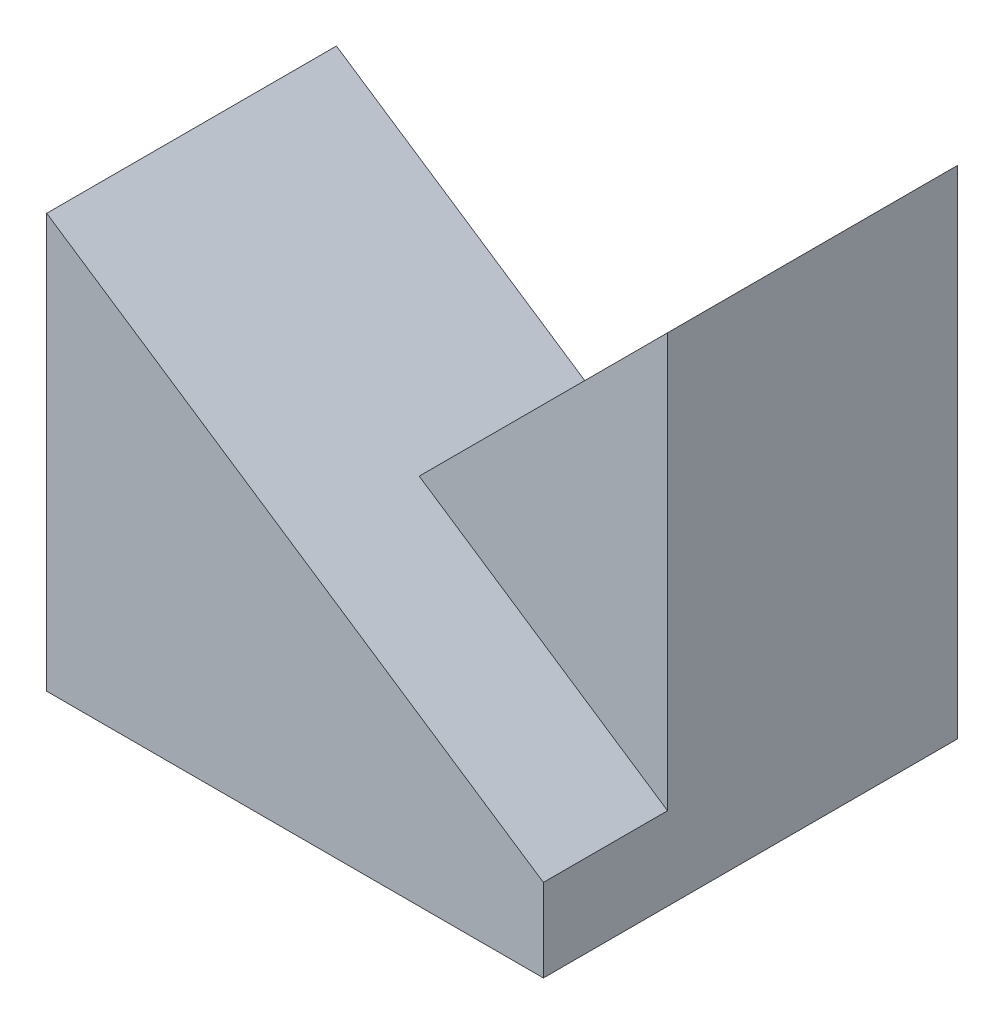
ISO-10303-21;
HEADER;
FILE_DESCRIPTION(('STEP AP214'),'2;1');
FILE_NAME('part.step','',(''),(''),'','','');
FILE_SCHEMA(('AUTOMOTIVE_DESIGN { 1 0 10303 214 1 1 1 1 }'));
ENDSEC;
DATA;
#1=APPLICATION_CONTEXT('core data for automotive mechanical design processes');
#2=APPLICATION_PROTOCOL_DEFINITION('international standard','automotive_design',2000,#1);
#3=PRODUCT_CONTEXT('',#1,'mechanical');
#4=PRODUCT('Part','Part','',(#3));
#5=PRODUCT_RELATED_PRODUCT_CATEGORY('part','',(#4));
#6=PRODUCT_DEFINITION_FORMATION('','',#4);
#7=PRODUCT_DEFINITION_CONTEXT('part definition',#1,'design');
#8=PRODUCT_DEFINITION('design','',#6,#7);
#9=PRODUCT_DEFINITION_SHAPE('','',#8);
#10=(LENGTH_UNIT() NAMED_UNIT(*) SI_UNIT(.MILLI.,.METRE.));
#11=(NAMED_UNIT(*) PLANE_ANGLE_UNIT() SI_UNIT($,.RADIAN.));
#12=(NAMED_UNIT(*) SI_UNIT($,.STERADIAN.) SOLID_ANGLE_UNIT());
#13=UNCERTAINTY_MEASURE_WITH_UNIT(LENGTH_MEASURE(1.E-05),#10,'distance_accuracy_value','');
#14=(GEOMETRIC_REPRESENTATION_CONTEXT(3) GLOBAL_UNCERTAINTY_ASSIGNED_CONTEXT((#13)) GLOBAL_UNIT_ASSIGNED_CONTEXT((#10,
#11,#12)) REPRESENTATION_CONTEXT('',''));
#15=CARTESIAN_POINT('',(0.,0.,0.));
#16=DIRECTION('',(0.,0.,1.));
#17=DIRECTION('',(1.,0.,0.));
#18=AXIS2_PLACEMENT_3D('',#15,#16,#17);
#19=CARTESIAN_POINT('',(-3.,6.,-2.5));
#20=DIRECTION('',(0.,0.,1.));
#21=DIRECTION('',(1.,0.,0.));
#22=AXIS2_PLACEMENT_3D('',#19,#20,#21);
#23=PLANE('',#22);
#24=DIRECTION('',(-1.,0.,0.));
#25=VECTOR('',#24,1.);
#26=CARTESIAN_POINT('',(-3.,0.,-2.5));
#27=LINE('',#26,#25);
#28=CARTESIAN_POINT('',(3.,0.,-2.5));
#29=VERTEX_POINT('',#28);
#30=CARTESIAN_POINT('',(-3.,0.,-2.5));
#31=VERTEX_POINT('',#30);
#32=EDGE_CURVE('E119',#29,#31,#27,.T.);
#33=ORIENTED_EDGE('',*,*,#32,.T.);
#34=DIRECTION('',(-0.707106781186548,-0.707106781186548,0.));
#35=VECTOR('',#34,1.);
#36=CARTESIAN_POINT('',(-1.5,1.5,-2.5));
#37=LINE('',#36,#35);
#38=CARTESIAN_POINT('',(3.,6.,-2.5));
#39=VERTEX_POINT('',#38);
#40=EDGE_CURVE('E95',#39,#31,#37,.T.);
#41=ORIENTED_EDGE('',*,*,#40,.F.);
#42=DIRECTION('',(0.,-1.,0.));
#43=VECTOR('',#42,1.);
#44=CARTESIAN_POINT('',(3.,6.,-2.5));
#45=LINE('',#44,#43);
#46=EDGE_CURVE('E11',#39,#29,#45,.T.);
#47=ORIENTED_EDGE('',*,*,#46,.T.);
#48=EDGE_LOOP('',(#33,#41,#47));
#49=FACE_BOUND('',#48,.T.);
#50=ADVANCED_FACE('F33',(#49),#23,.F.);
#51=CARTESIAN_POINT('',(-3.,6.,2.5));
#52=DIRECTION('',(1.,0.,0.));
#53=DIRECTION('',(0.,0.,-1.));
#54=AXIS2_PLACEMENT_3D('',#51,#52,#53);
#55=PLANE('',#54);
#56=DIRECTION('',(0.,0.,1.));
#57=VECTOR('',#56,1.);
#58=CARTESIAN_POINT('',(-3.,5.,-1.));
#59=LINE('',#58,#57);
#60=CARTESIAN_POINT('',(-3.,5.,-1.));
#61=VERTEX_POINT('',#60);
#62=CARTESIAN_POINT('',(-3.,5.,2.5));
#63=VERTEX_POINT('',#62);
#64=EDGE_CURVE('E114',#61,#63,#59,.T.);
#65=ORIENTED_EDGE('',*,*,#64,.F.);
#66=DIRECTION('',(0.,1.,0.));
#67=VECTOR('',#66,1.);
#68=CARTESIAN_POINT('',(-3.,0.,-1.));
#69=LINE('',#68,#67);
#70=CARTESIAN_POINT('',(-3.,0.,-1.));
#71=VERTEX_POINT('',#70);
#72=EDGE_CURVE('E105',#71,#61,#69,.T.);
#73=ORIENTED_EDGE('',*,*,#72,.F.);
#74=DIRECTION('',(0.,0.,1.));
#75=VECTOR('',#74,1.);
#76=CARTESIAN_POINT('',(-3.,0.,2.5));
#77=LINE('',#76,#75);
#78=CARTESIAN_POINT('',(-3.,0.,2.5));
#79=VERTEX_POINT('',#78);
#80=EDGE_CURVE('E100',#71,#79,#77,.T.);
#81=ORIENTED_EDGE('',*,*,#80,.T.);
#82=DIRECTION('',(0.,-1.,0.));
#83=VECTOR('',#82,1.);
#84=CARTESIAN_POINT('',(-3.,6.,2.5));
#85=LINE('',#84,#83);
#86=EDGE_CURVE('E41',#63,#79,#85,.T.);
#87=ORIENTED_EDGE('',*,*,#86,.F.);
#88=EDGE_LOOP('',(#65,#73,#81,#87));
#89=FACE_BOUND('',#88,.T.);
#90=ADVANCED_FACE('F111',(#89),#55,.F.);
#91=CARTESIAN_POINT('',(-3.,6.,2.5));
#92=DIRECTION('',(0.,0.,-1.));
#93=DIRECTION('',(-1.,0.,0.));
#94=AXIS2_PLACEMENT_3D('',#91,#92,#93);
#95=PLANE('',#94);
#96=DIRECTION('',(0.,-1.,0.));
#97=VECTOR('',#96,1.);
#98=CARTESIAN_POINT('',(3.,6.,2.5));
#99=LINE('',#98,#97);
#100=CARTESIAN_POINT('',(3.,1.,2.5));
#101=VERTEX_POINT('',#100);
#102=CARTESIAN_POINT('',(3.,0.,2.5));
#103=VERTEX_POINT('',#102);
#104=EDGE_CURVE('E56',#101,#103,#99,.T.);
#105=ORIENTED_EDGE('',*,*,#104,.F.);
#106=DIRECTION('',(-0.832050294337844,0.554700196225229,0.));
#107=VECTOR('',#106,1.);
#108=CARTESIAN_POINT('',(1.38461538461538,2.07692307692308,2.5));
#109=LINE('',#108,#107);
#110=EDGE_CURVE('E129',#101,#63,#109,.T.);
#111=ORIENTED_EDGE('',*,*,#110,.T.);
#112=ORIENTED_EDGE('',*,*,#86,.T.);
#113=DIRECTION('',(1.,0.,0.));
#114=VECTOR('',#113,1.);
#115=CARTESIAN_POINT('',(-3.,0.,2.5));
#116=LINE('',#115,#114);
#117=EDGE_CURVE('E99',#79,#103,#116,.T.);
#118=ORIENTED_EDGE('',*,*,#117,.T.);
#119=EDGE_LOOP('',(#105,#111,#112,#118));
#120=FACE_BOUND('',#119,.T.);
#121=ADVANCED_FACE('F128',(#120),#95,.F.);
#122=CARTESIAN_POINT('',(3.,6.,2.5));
#123=DIRECTION('',(-1.,0.,0.));
#124=DIRECTION('',(0.,0.,1.));
#125=AXIS2_PLACEMENT_3D('',#122,#123,#124);
#126=PLANE('',#125);
#127=DIRECTION('',(0.,1.,0.));
#128=VECTOR('',#127,1.);
#129=CARTESIAN_POINT('',(3.,1.,1.));
#130=LINE('',#129,#128);
#131=CARTESIAN_POINT('',(3.,1.,1.));
#132=VERTEX_POINT('',#131);
#133=CARTESIAN_POINT('',(3.,6.,1.));
#134=VERTEX_POINT('',#133);
#135=EDGE_CURVE('E134',#132,#134,#130,.T.);
#136=ORIENTED_EDGE('',*,*,#135,.F.);
#137=DIRECTION('',(0.,0.,1.));
#138=VECTOR('',#137,1.);
#139=CARTESIAN_POINT('',(3.,1.,1.));
#140=LINE('',#139,#138);
#141=EDGE_CURVE('E131',#132,#101,#140,.T.);
#142=ORIENTED_EDGE('',*,*,#141,.T.);
#143=ORIENTED_EDGE('',*,*,#104,.T.);
#144=DIRECTION('',(0.,0.,-1.));
#145=VECTOR('',#144,1.);
#146=CARTESIAN_POINT('',(3.,0.,2.5));
#147=LINE('',#146,#145);
#148=EDGE_CURVE('E120',#103,#29,#147,.T.);
#149=ORIENTED_EDGE('',*,*,#148,.T.);
#150=ORIENTED_EDGE('',*,*,#46,.F.);
#151=DIRECTION('',(0.,0.,-1.));
#152=VECTOR('',#151,1.);
#153=CARTESIAN_POINT('',(3.,6.,2.5));
#154=LINE('',#153,#152);
#155=EDGE_CURVE('E125',#134,#39,#154,.T.);
#156=ORIENTED_EDGE('',*,*,#155,.F.);
#157=EDGE_LOOP('',(#136,#142,#143,#149,#150,#156));
#158=FACE_BOUND('',#157,.T.);
#159=ADVANCED_FACE('F35',(#158),#126,.F.);
#160=CARTESIAN_POINT('',(0.,0.,0.));
#161=DIRECTION('',(0.,-1.,0.));
#162=DIRECTION('',(0.,0.,-1.));
#163=AXIS2_PLACEMENT_3D('',#160,#161,#162);
#164=PLANE('',#163);
#165=ORIENTED_EDGE('',*,*,#148,.F.);
#166=ORIENTED_EDGE('',*,*,#117,.F.);
#167=ORIENTED_EDGE('',*,*,#80,.F.);
#168=EDGE_CURVE('E89',#31,#71,#77,.T.);
#169=ORIENTED_EDGE('',*,*,#168,.F.);
#170=ORIENTED_EDGE('',*,*,#32,.F.);
#171=EDGE_LOOP('',(#165,#166,#167,#169,#170));
#172=FACE_BOUND('',#171,.T.);
#173=ADVANCED_FACE('F118',(#172),#164,.T.);
#174=CARTESIAN_POINT('',(1.38461538461538,2.07692307692308,-1.));
#175=DIRECTION('',(0.554700196225229,0.832050294337844,0.));
#176=DIRECTION('',(-0.832050294337844,0.554700196225229,0.));
#177=AXIS2_PLACEMENT_3D('',#174,#175,#176);
#178=PLANE('',#177);
#179=ORIENTED_EDGE('',*,*,#110,.F.);
#180=ORIENTED_EDGE('',*,*,#141,.F.);
#181=DIRECTION('',(0.832050294337844,-0.554700196225229,0.));
#182=VECTOR('',#181,1.);
#183=CARTESIAN_POINT('',(0.,3.,1.));
#184=LINE('',#183,#182);
#185=CARTESIAN_POINT('',(0.,3.,1.));
#186=VERTEX_POINT('',#185);
#187=EDGE_CURVE('E145',#186,#132,#184,.T.);
#188=ORIENTED_EDGE('',*,*,#187,.F.);
#189=DIRECTION('',(0.,0.,1.));
#190=VECTOR('',#189,1.);
#191=CARTESIAN_POINT('',(0.,3.,-1.));
#192=LINE('',#191,#190);
#193=CARTESIAN_POINT('',(0.,3.,-1.));
#194=VERTEX_POINT('',#193);
#195=EDGE_CURVE('E48',#194,#186,#192,.T.);
#196=ORIENTED_EDGE('',*,*,#195,.F.);
#197=DIRECTION('',(-0.832050294337844,0.554700196225229,0.));
#198=VECTOR('',#197,1.);
#199=CARTESIAN_POINT('',(1.38461538461538,2.07692307692308,-1.));
#200=LINE('',#199,#198);
#201=EDGE_CURVE('E107',#194,#61,#200,.T.);
#202=ORIENTED_EDGE('',*,*,#201,.T.);
#203=ORIENTED_EDGE('',*,*,#64,.T.);
#204=EDGE_LOOP('',(#179,#180,#188,#196,#202,#203));
#205=FACE_BOUND('',#204,.T.);
#206=ADVANCED_FACE('F154',(#205),#178,.T.);
#207=CARTESIAN_POINT('',(0.,0.,1.));
#208=DIRECTION('',(0.,0.,-1.));
#209=DIRECTION('',(-1.,0.,0.));
#210=AXIS2_PLACEMENT_3D('',#207,#208,#209);
#211=PLANE('',#210);
#212=ORIENTED_EDGE('',*,*,#135,.T.);
#213=DIRECTION('',(-0.707106781186548,-0.707106781186548,0.));
#214=VECTOR('',#213,1.);
#215=CARTESIAN_POINT('',(-1.5,1.5,1.));
#216=LINE('',#215,#214);
#217=EDGE_CURVE('E143',#134,#186,#216,.T.);
#218=ORIENTED_EDGE('',*,*,#217,.T.);
#219=ORIENTED_EDGE('',*,*,#187,.T.);
#220=EDGE_LOOP('',(#212,#218,#219));
#221=FACE_BOUND('',#220,.T.);
#222=ADVANCED_FACE('F152',(#221),#211,.F.);
#223=CARTESIAN_POINT('',(-1.5,1.5,1.));
#224=DIRECTION('',(0.707106781186547,-0.707106781186547,0.));
#225=DIRECTION('',(0.707106781186548,0.707106781186548,0.));
#226=AXIS2_PLACEMENT_3D('',#223,#224,#225);
#227=PLANE('',#226);
#228=ORIENTED_EDGE('',*,*,#40,.T.);
#229=ORIENTED_EDGE('',*,*,#168,.T.);
#230=DIRECTION('',(-0.707106781186547,-0.707106781186547,0.));
#231=VECTOR('',#230,1.);
#232=CARTESIAN_POINT('',(0.,3.,-1.));
#233=LINE('',#232,#231);
#234=EDGE_CURVE('E92',#194,#71,#233,.T.);
#235=ORIENTED_EDGE('',*,*,#234,.F.);
#236=ORIENTED_EDGE('',*,*,#195,.T.);
#237=ORIENTED_EDGE('',*,*,#217,.F.);
#238=ORIENTED_EDGE('',*,*,#155,.T.);
#239=EDGE_LOOP('',(#228,#229,#235,#236,#237,#238));
#240=FACE_BOUND('',#239,.T.);
#241=ADVANCED_FACE('F91',(#240),#227,.F.);
#242=CARTESIAN_POINT('',(0.,0.,-1.));
#243=DIRECTION('',(0.,0.,1.));
#244=DIRECTION('',(1.,0.,0.));
#245=AXIS2_PLACEMENT_3D('',#242,#243,#244);
#246=PLANE('',#245);
#247=ORIENTED_EDGE('',*,*,#201,.F.);
#248=ORIENTED_EDGE('',*,*,#234,.T.);
#249=ORIENTED_EDGE('',*,*,#72,.T.);
#250=EDGE_LOOP('',(#247,#248,#249));
#251=FACE_BOUND('',#250,.T.);
#252=ADVANCED_FACE('F104',(#251),#246,.F.);
#253=CLOSED_SHELL('',(#50,#90,#121,#159,#173,#206,#222,#241,#252));
#254=MANIFOLD_SOLID_BREP('B2',#253);
#255=ADVANCED_BREP_SHAPE_REPRESENTATION('',(#18,#254),#14);
#256=SHAPE_DEFINITION_REPRESENTATION(#9,#255);
ENDSEC;
END-ISO-10303-21;
